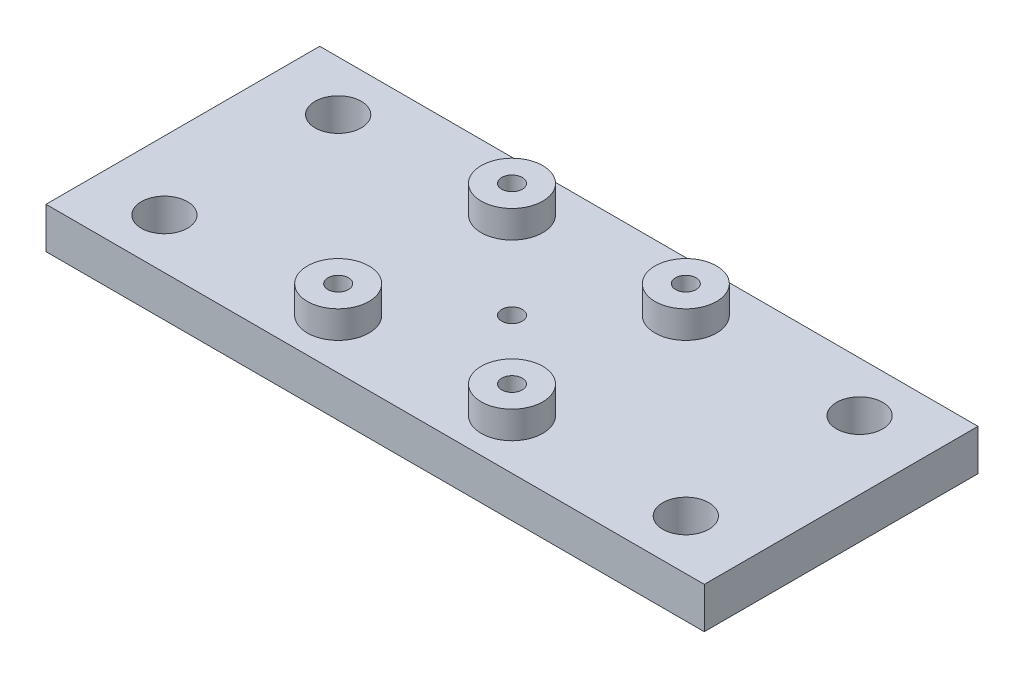
ISO-10303-21;
HEADER;
FILE_DESCRIPTION(('STEP AP214'),'2;1');
FILE_NAME('part.step','',(''),(''),'','','');
FILE_SCHEMA(('AUTOMOTIVE_DESIGN { 1 0 10303 214 1 1 1 1 }'));
ENDSEC;
DATA;
#1=APPLICATION_CONTEXT('core data for automotive mechanical design processes');
#2=APPLICATION_PROTOCOL_DEFINITION('international standard','automotive_design',2000,#1);
#3=PRODUCT_CONTEXT('',#1,'mechanical');
#4=PRODUCT('Part','Part','',(#3));
#5=PRODUCT_RELATED_PRODUCT_CATEGORY('part','',(#4));
#6=PRODUCT_DEFINITION_FORMATION('','',#4);
#7=PRODUCT_DEFINITION_CONTEXT('part definition',#1,'design');
#8=PRODUCT_DEFINITION('design','',#6,#7);
#9=PRODUCT_DEFINITION_SHAPE('','',#8);
#10=(LENGTH_UNIT() NAMED_UNIT(*) SI_UNIT(.MILLI.,.METRE.));
#11=(NAMED_UNIT(*) PLANE_ANGLE_UNIT() SI_UNIT($,.RADIAN.));
#12=(NAMED_UNIT(*) SI_UNIT($,.STERADIAN.) SOLID_ANGLE_UNIT());
#13=UNCERTAINTY_MEASURE_WITH_UNIT(LENGTH_MEASURE(1.E-05),#10,'distance_accuracy_value','');
#14=(GEOMETRIC_REPRESENTATION_CONTEXT(3) GLOBAL_UNCERTAINTY_ASSIGNED_CONTEXT((#13)) GLOBAL_UNIT_ASSIGNED_CONTEXT((#10,
#11,#12)) REPRESENTATION_CONTEXT('',''));
#15=CARTESIAN_POINT('',(0.,0.,0.));
#16=DIRECTION('',(0.,0.,1.));
#17=DIRECTION('',(1.,0.,0.));
#18=AXIS2_PLACEMENT_3D('',#15,#16,#17);
#19=CARTESIAN_POINT('',(70.6318886716207,6.,-52.4553945983698));
#20=DIRECTION('',(0.,-1.,0.));
#21=DIRECTION('',(0.,0.,-1.));
#22=AXIS2_PLACEMENT_3D('',#19,#20,#21);
#23=CYLINDRICAL_SURFACE('',#22,1.5);
#24=CARTESIAN_POINT('',(70.6318886716207,6.,-52.4553945983698));
#25=DIRECTION('',(0.,1.,0.));
#26=DIRECTION('',(0.,0.,1.));
#27=AXIS2_PLACEMENT_3D('',#24,#25,#26);
#28=CIRCLE('',#27,1.5);
#29=CARTESIAN_POINT('',(70.6318886716207,6.,-50.9553945983698));
#30=VERTEX_POINT('',#29);
#31=EDGE_CURVE('E121',#30,#30,#28,.T.);
#32=ORIENTED_EDGE('',*,*,#31,.T.);
#33=EDGE_LOOP('',(#32));
#34=FACE_BOUND('',#33,.T.);
#35=CARTESIAN_POINT('',(70.6318886716207,3.3,-52.4553945983698));
#36=DIRECTION('',(0.,-1.,0.));
#37=DIRECTION('',(0.,0.,-1.));
#38=AXIS2_PLACEMENT_3D('',#35,#36,#37);
#39=CIRCLE('',#38,1.5);
#40=CARTESIAN_POINT('',(70.6318886716207,3.3,-53.9553945983698));
#41=VERTEX_POINT('',#40);
#42=EDGE_CURVE('E45',#41,#41,#39,.T.);
#43=ORIENTED_EDGE('',*,*,#42,.T.);
#44=EDGE_LOOP('',(#43));
#45=FACE_BOUND('',#44,.T.);
#46=ADVANCED_FACE('F41',(#34,#45),#23,.F.);
#47=CARTESIAN_POINT('',(0.,6.,0.));
#48=DIRECTION('',(0.,1.,0.));
#49=DIRECTION('',(0.,0.,1.));
#50=AXIS2_PLACEMENT_3D('',#47,#48,#49);
#51=PLANE('',#50);
#52=CARTESIAN_POINT('',(57.9318886716207,6.,-65.1553945983698));
#53=DIRECTION('',(0.,1.,0.));
#54=DIRECTION('',(0.,0.,1.));
#55=AXIS2_PLACEMENT_3D('',#52,#53,#54);
#56=CIRCLE('',#55,4.50000000000001);
#57=CARTESIAN_POINT('',(57.9318886716207,6.,-60.6553945983697));
#58=VERTEX_POINT('',#57);
#59=EDGE_CURVE('E231',#58,#58,#56,.T.);
#60=ORIENTED_EDGE('',*,*,#59,.F.);
#61=EDGE_LOOP('',(#60));
#62=FACE_BOUND('',#61,.T.);
#63=CARTESIAN_POINT('',(32.5318886716207,6.,-39.7553945983697));
#64=DIRECTION('',(0.,1.,0.));
#65=DIRECTION('',(0.,0.,1.));
#66=AXIS2_PLACEMENT_3D('',#63,#64,#65);
#67=CIRCLE('',#66,3.37343749999996);
#68=CARTESIAN_POINT('',(32.5318886716207,6.,-36.3819570983698));
#69=VERTEX_POINT('',#68);
#70=EDGE_CURVE('E176',#69,#69,#67,.T.);
#71=ORIENTED_EDGE('',*,*,#70,.F.);
#72=EDGE_LOOP('',(#71));
#73=FACE_BOUND('',#72,.T.);
#74=CARTESIAN_POINT('',(32.5318886716207,6.,-65.1553945983698));
#75=DIRECTION('',(0.,1.,0.));
#76=DIRECTION('',(0.,0.,1.));
#77=AXIS2_PLACEMENT_3D('',#74,#75,#76);
#78=CIRCLE('',#77,3.37343749999996);
#79=CARTESIAN_POINT('',(32.5318886716207,6.,-61.7819570983698));
#80=VERTEX_POINT('',#79);
#81=EDGE_CURVE('E115',#80,#80,#78,.T.);
#82=ORIENTED_EDGE('',*,*,#81,.F.);
#83=EDGE_LOOP('',(#82));
#84=FACE_BOUND('',#83,.T.);
#85=DIRECTION('',(0.,0.,-1.));
#86=VECTOR('',#85,1.);
#87=CARTESIAN_POINT('',(22.5318886716207,6.,0.));
#88=LINE('',#87,#86);
#89=CARTESIAN_POINT('',(22.5318886716207,6.,-32.4553945983698));
#90=VERTEX_POINT('',#89);
#91=CARTESIAN_POINT('',(22.5318886716207,6.,-72.4553945983698));
#92=VERTEX_POINT('',#91);
#93=EDGE_CURVE('E111',#90,#92,#88,.T.);
#94=ORIENTED_EDGE('',*,*,#93,.F.);
#95=DIRECTION('',(-1.,0.,0.));
#96=VECTOR('',#95,1.);
#97=CARTESIAN_POINT('',(0.,6.,-32.4553945983698));
#98=LINE('',#97,#96);
#99=CARTESIAN_POINT('',(118.731888671621,6.,-32.4553945983698));
#100=VERTEX_POINT('',#99);
#101=EDGE_CURVE('E96',#100,#90,#98,.T.);
#102=ORIENTED_EDGE('',*,*,#101,.F.);
#103=DIRECTION('',(0.,0.,-1.));
#104=VECTOR('',#103,1.);
#105=CARTESIAN_POINT('',(118.731888671621,6.,0.));
#106=LINE('',#105,#104);
#107=CARTESIAN_POINT('',(118.731888671621,6.,-72.4553945983698));
#108=VERTEX_POINT('',#107);
#109=EDGE_CURVE('E105',#100,#108,#106,.T.);
#110=ORIENTED_EDGE('',*,*,#109,.T.);
#111=DIRECTION('',(-1.,0.,0.));
#112=VECTOR('',#111,1.);
#113=CARTESIAN_POINT('',(0.,6.,-72.4553945983698));
#114=LINE('',#113,#112);
#115=EDGE_CURVE('E60',#108,#92,#114,.T.);
#116=ORIENTED_EDGE('',*,*,#115,.T.);
#117=EDGE_LOOP('',(#94,#102,#110,#116));
#118=FACE_BOUND('',#117,.T.);
#119=ORIENTED_EDGE('',*,*,#31,.F.);
#120=EDGE_LOOP('',(#119));
#121=FACE_BOUND('',#120,.T.);
#122=CARTESIAN_POINT('',(108.731888671621,6.,-39.7553945983698));
#123=DIRECTION('',(0.,1.,0.));
#124=DIRECTION('',(0.,0.,1.));
#125=AXIS2_PLACEMENT_3D('',#122,#123,#124);
#126=CIRCLE('',#125,3.37343749999996);
#127=CARTESIAN_POINT('',(108.731888671621,6.,-36.3819570983698));
#128=VERTEX_POINT('',#127);
#129=EDGE_CURVE('E125',#128,#128,#126,.T.);
#130=ORIENTED_EDGE('',*,*,#129,.F.);
#131=EDGE_LOOP('',(#130));
#132=FACE_BOUND('',#131,.T.);
#133=CARTESIAN_POINT('',(108.731888671621,6.,-65.1553945983698));
#134=DIRECTION('',(0.,1.,0.));
#135=DIRECTION('',(0.,0.,1.));
#136=AXIS2_PLACEMENT_3D('',#133,#134,#135);
#137=CIRCLE('',#136,3.37343749999996);
#138=CARTESIAN_POINT('',(108.731888671621,6.,-61.7819570983698));
#139=VERTEX_POINT('',#138);
#140=EDGE_CURVE('E129',#139,#139,#137,.T.);
#141=ORIENTED_EDGE('',*,*,#140,.F.);
#142=EDGE_LOOP('',(#141));
#143=FACE_BOUND('',#142,.T.);
#144=CARTESIAN_POINT('',(83.3318886716207,6.,-65.1553945983698));
#145=DIRECTION('',(0.,1.,0.));
#146=DIRECTION('',(0.,0.,1.));
#147=AXIS2_PLACEMENT_3D('',#144,#145,#146);
#148=CIRCLE('',#147,4.50000000000001);
#149=CARTESIAN_POINT('',(83.3318886716207,6.,-60.6553945983697));
#150=VERTEX_POINT('',#149);
#151=EDGE_CURVE('E52',#150,#150,#148,.T.);
#152=ORIENTED_EDGE('',*,*,#151,.F.);
#153=EDGE_LOOP('',(#152));
#154=FACE_BOUND('',#153,.T.);
#155=CARTESIAN_POINT('',(57.9318886716207,6.,-39.7553945983698));
#156=DIRECTION('',(0.,1.,0.));
#157=DIRECTION('',(0.,0.,1.));
#158=AXIS2_PLACEMENT_3D('',#155,#156,#157);
#159=CIRCLE('',#158,4.50000000000001);
#160=CARTESIAN_POINT('',(57.9318886716207,6.,-35.2553945983698));
#161=VERTEX_POINT('',#160);
#162=EDGE_CURVE('E11',#161,#161,#159,.T.);
#163=ORIENTED_EDGE('',*,*,#162,.F.);
#164=EDGE_LOOP('',(#163));
#165=FACE_BOUND('',#164,.T.);
#166=CARTESIAN_POINT('',(83.3318886716207,6.,-39.7553945983698));
#167=DIRECTION('',(0.,1.,0.));
#168=DIRECTION('',(0.,0.,-1.));
#169=AXIS2_PLACEMENT_3D('',#166,#167,#168);
#170=CIRCLE('',#169,4.50000000000001);
#171=CARTESIAN_POINT('',(83.3318886716207,6.,-44.2553945983698));
#172=VERTEX_POINT('',#171);
#173=EDGE_CURVE('E198',#172,#172,#170,.T.);
#174=ORIENTED_EDGE('',*,*,#173,.F.);
#175=EDGE_LOOP('',(#174));
#176=FACE_BOUND('',#175,.T.);
#177=ADVANCED_FACE('F109',(#62,#73,#84,#118,#121,#132,#143,#154,#165,#176),#51,.T.);
#178=CARTESIAN_POINT('',(22.5318886716207,6.,0.));
#179=DIRECTION('',(-1.,0.,0.));
#180=DIRECTION('',(0.,0.,1.));
#181=AXIS2_PLACEMENT_3D('',#178,#179,#180);
#182=PLANE('',#181);
#183=DIRECTION('',(0.,0.,-1.));
#184=VECTOR('',#183,1.);
#185=CARTESIAN_POINT('',(22.5318886716207,0.,0.));
#186=LINE('',#185,#184);
#187=CARTESIAN_POINT('',(22.5318886716207,0.,-32.4553945983698));
#188=VERTEX_POINT('',#187);
#189=CARTESIAN_POINT('',(22.5318886716207,0.,-72.4553945983698));
#190=VERTEX_POINT('',#189);
#191=EDGE_CURVE('E142',#188,#190,#186,.T.);
#192=ORIENTED_EDGE('',*,*,#191,.F.);
#193=DIRECTION('',(0.,-1.,0.));
#194=VECTOR('',#193,1.);
#195=CARTESIAN_POINT('',(22.5318886716207,6.,-32.4553945983698));
#196=LINE('',#195,#194);
#197=EDGE_CURVE('E87',#90,#188,#196,.T.);
#198=ORIENTED_EDGE('',*,*,#197,.F.);
#199=ORIENTED_EDGE('',*,*,#93,.T.);
#200=DIRECTION('',(0.,-1.,0.));
#201=VECTOR('',#200,1.);
#202=CARTESIAN_POINT('',(22.5318886716207,6.,-72.4553945983698));
#203=LINE('',#202,#201);
#204=EDGE_CURVE('E84',#92,#190,#203,.T.);
#205=ORIENTED_EDGE('',*,*,#204,.T.);
#206=EDGE_LOOP('',(#192,#198,#199,#205));
#207=FACE_BOUND('',#206,.T.);
#208=ADVANCED_FACE('F191',(#207),#182,.T.);
#209=CARTESIAN_POINT('',(0.,6.,-32.4553945983698));
#210=DIRECTION('',(0.,0.,1.));
#211=DIRECTION('',(1.,0.,0.));
#212=AXIS2_PLACEMENT_3D('',#209,#210,#211);
#213=PLANE('',#212);
#214=DIRECTION('',(-1.,0.,0.));
#215=VECTOR('',#214,1.);
#216=CARTESIAN_POINT('',(0.,0.,-32.4553945983698));
#217=LINE('',#216,#215);
#218=CARTESIAN_POINT('',(118.731888671621,0.,-32.4553945983698));
#219=VERTEX_POINT('',#218);
#220=EDGE_CURVE('E98',#219,#188,#217,.T.);
#221=ORIENTED_EDGE('',*,*,#220,.F.);
#222=DIRECTION('',(0.,-1.,0.));
#223=VECTOR('',#222,1.);
#224=CARTESIAN_POINT('',(118.731888671621,6.,-32.4553945983698));
#225=LINE('',#224,#223);
#226=EDGE_CURVE('E92',#100,#219,#225,.T.);
#227=ORIENTED_EDGE('',*,*,#226,.F.);
#228=ORIENTED_EDGE('',*,*,#101,.T.);
#229=ORIENTED_EDGE('',*,*,#197,.T.);
#230=EDGE_LOOP('',(#221,#227,#228,#229));
#231=FACE_BOUND('',#230,.T.);
#232=ADVANCED_FACE('F94',(#231),#213,.T.);
#233=CARTESIAN_POINT('',(118.731888671621,6.,0.));
#234=DIRECTION('',(-1.,0.,0.));
#235=DIRECTION('',(0.,0.,1.));
#236=AXIS2_PLACEMENT_3D('',#233,#234,#235);
#237=PLANE('',#236);
#238=DIRECTION('',(0.,0.,-1.));
#239=VECTOR('',#238,1.);
#240=CARTESIAN_POINT('',(118.731888671621,0.,0.));
#241=LINE('',#240,#239);
#242=CARTESIAN_POINT('',(118.731888671621,0.,-72.4553945983698));
#243=VERTEX_POINT('',#242);
#244=EDGE_CURVE('E147',#219,#243,#241,.T.);
#245=ORIENTED_EDGE('',*,*,#244,.T.);
#246=DIRECTION('',(0.,-1.,0.));
#247=VECTOR('',#246,1.);
#248=CARTESIAN_POINT('',(118.731888671621,6.,-72.4553945983698));
#249=LINE('',#248,#247);
#250=EDGE_CURVE('E102',#108,#243,#249,.T.);
#251=ORIENTED_EDGE('',*,*,#250,.F.);
#252=ORIENTED_EDGE('',*,*,#109,.F.);
#253=ORIENTED_EDGE('',*,*,#226,.T.);
#254=EDGE_LOOP('',(#245,#251,#252,#253));
#255=FACE_BOUND('',#254,.T.);
#256=ADVANCED_FACE('F106',(#255),#237,.F.);
#257=CARTESIAN_POINT('',(108.731888671621,6.,-39.7553945983698));
#258=DIRECTION('',(0.,-1.,0.));
#259=DIRECTION('',(0.,0.,-1.));
#260=AXIS2_PLACEMENT_3D('',#257,#258,#259);
#261=CYLINDRICAL_SURFACE('',#260,3.37343749999996);
#262=ORIENTED_EDGE('',*,*,#129,.T.);
#263=EDGE_LOOP('',(#262));
#264=FACE_BOUND('',#263,.T.);
#265=CARTESIAN_POINT('',(108.731888671621,0.,-39.7553945983698));
#266=DIRECTION('',(0.,1.,0.));
#267=DIRECTION('',(0.,0.,1.));
#268=AXIS2_PLACEMENT_3D('',#265,#266,#267);
#269=CIRCLE('',#268,3.37343749999996);
#270=CARTESIAN_POINT('',(108.731888671621,0.,-36.3819570983698));
#271=VERTEX_POINT('',#270);
#272=EDGE_CURVE('E168',#271,#271,#269,.T.);
#273=ORIENTED_EDGE('',*,*,#272,.F.);
#274=EDGE_LOOP('',(#273));
#275=FACE_BOUND('',#274,.T.);
#276=ADVANCED_FACE('F293',(#264,#275),#261,.F.);
#277=CARTESIAN_POINT('',(57.9318886716207,6.,-65.1553945983698));
#278=DIRECTION('',(0.,-1.,0.));
#279=DIRECTION('',(0.,0.,-1.));
#280=AXIS2_PLACEMENT_3D('',#277,#278,#279);
#281=CYLINDRICAL_SURFACE('',#280,1.5);
#282=CARTESIAN_POINT('',(57.9318886716207,0.,-65.1553945983698));
#283=DIRECTION('',(0.,1.,0.));
#284=DIRECTION('',(0.,0.,1.));
#285=AXIS2_PLACEMENT_3D('',#282,#283,#284);
#286=CIRCLE('',#285,1.5);
#287=CARTESIAN_POINT('',(57.9318886716207,0.,-63.6553945983697));
#288=VERTEX_POINT('',#287);
#289=EDGE_CURVE('E164',#288,#288,#286,.T.);
#290=ORIENTED_EDGE('',*,*,#289,.F.);
#291=EDGE_LOOP('',(#290));
#292=FACE_BOUND('',#291,.T.);
#293=CARTESIAN_POINT('',(57.9318886716207,10.,-65.1553945983698));
#294=DIRECTION('',(0.,1.,0.));
#295=DIRECTION('',(0.,0.,1.));
#296=AXIS2_PLACEMENT_3D('',#293,#294,#295);
#297=CIRCLE('',#296,1.5);
#298=CARTESIAN_POINT('',(57.9318886716207,10.,-63.6553945983697));
#299=VERTEX_POINT('',#298);
#300=EDGE_CURVE('E227',#299,#299,#297,.T.);
#301=ORIENTED_EDGE('',*,*,#300,.T.);
#302=EDGE_LOOP('',(#301));
#303=FACE_BOUND('',#302,.T.);
#304=ADVANCED_FACE('F315',(#292,#303),#281,.F.);
#305=CARTESIAN_POINT('',(83.3318886716207,6.,-65.1553945983698));
#306=DIRECTION('',(0.,-1.,0.));
#307=DIRECTION('',(0.,0.,-1.));
#308=AXIS2_PLACEMENT_3D('',#305,#306,#307);
#309=CYLINDRICAL_SURFACE('',#308,1.5);
#310=CARTESIAN_POINT('',(83.3318886716207,0.,-65.1553945983698));
#311=DIRECTION('',(0.,1.,0.));
#312=DIRECTION('',(0.,0.,1.));
#313=AXIS2_PLACEMENT_3D('',#310,#311,#312);
#314=CIRCLE('',#313,1.5);
#315=CARTESIAN_POINT('',(83.3318886716207,0.,-63.6553945983697));
#316=VERTEX_POINT('',#315);
#317=EDGE_CURVE('E160',#316,#316,#314,.T.);
#318=ORIENTED_EDGE('',*,*,#317,.F.);
#319=EDGE_LOOP('',(#318));
#320=FACE_BOUND('',#319,.T.);
#321=CARTESIAN_POINT('',(83.3318886716207,10.,-65.1553945983698));
#322=DIRECTION('',(0.,-1.,0.));
#323=DIRECTION('',(0.,0.,1.));
#324=AXIS2_PLACEMENT_3D('',#321,#322,#323);
#325=CIRCLE('',#324,1.5);
#326=CARTESIAN_POINT('',(83.3318886716207,10.,-63.6553945983697));
#327=VERTEX_POINT('',#326);
#328=EDGE_CURVE('E219',#327,#327,#325,.T.);
#329=ORIENTED_EDGE('',*,*,#328,.F.);
#330=EDGE_LOOP('',(#329));
#331=FACE_BOUND('',#330,.T.);
#332=ADVANCED_FACE('F323',(#320,#331),#309,.F.);
#333=CARTESIAN_POINT('',(83.3318886716207,6.,-39.7553945983698));
#334=DIRECTION('',(0.,-1.,0.));
#335=DIRECTION('',(0.,0.,-1.));
#336=AXIS2_PLACEMENT_3D('',#333,#334,#335);
#337=CYLINDRICAL_SURFACE('',#336,1.5);
#338=CARTESIAN_POINT('',(83.3318886716207,0.,-39.7553945983698));
#339=DIRECTION('',(0.,1.,0.));
#340=DIRECTION('',(0.,0.,1.));
#341=AXIS2_PLACEMENT_3D('',#338,#339,#340);
#342=CIRCLE('',#341,1.5);
#343=CARTESIAN_POINT('',(83.3318886716207,0.,-38.2553945983698));
#344=VERTEX_POINT('',#343);
#345=EDGE_CURVE('E156',#344,#344,#342,.T.);
#346=ORIENTED_EDGE('',*,*,#345,.F.);
#347=EDGE_LOOP('',(#346));
#348=FACE_BOUND('',#347,.T.);
#349=CARTESIAN_POINT('',(83.3318886716207,10.,-39.7553945983698));
#350=DIRECTION('',(0.,1.,0.));
#351=DIRECTION('',(0.,0.,-1.));
#352=AXIS2_PLACEMENT_3D('',#349,#350,#351);
#353=CIRCLE('',#352,1.5);
#354=CARTESIAN_POINT('',(83.3318886716207,10.,-41.2553945983698));
#355=VERTEX_POINT('',#354);
#356=EDGE_CURVE('E202',#355,#355,#353,.T.);
#357=ORIENTED_EDGE('',*,*,#356,.T.);
#358=EDGE_LOOP('',(#357));
#359=FACE_BOUND('',#358,.T.);
#360=ADVANCED_FACE('F332',(#348,#359),#337,.F.);
#361=CARTESIAN_POINT('',(57.9318886716207,6.,-39.7553945983698));
#362=DIRECTION('',(0.,-1.,0.));
#363=DIRECTION('',(0.,0.,-1.));
#364=AXIS2_PLACEMENT_3D('',#361,#362,#363);
#365=CYLINDRICAL_SURFACE('',#364,1.5);
#366=CARTESIAN_POINT('',(57.9318886716207,0.,-39.7553945983698));
#367=DIRECTION('',(0.,1.,0.));
#368=DIRECTION('',(0.,0.,1.));
#369=AXIS2_PLACEMENT_3D('',#366,#367,#368);
#370=CIRCLE('',#369,1.5);
#371=CARTESIAN_POINT('',(57.9318886716207,0.,-38.2553945983698));
#372=VERTEX_POINT('',#371);
#373=EDGE_CURVE('E152',#372,#372,#370,.T.);
#374=ORIENTED_EDGE('',*,*,#373,.F.);
#375=EDGE_LOOP('',(#374));
#376=FACE_BOUND('',#375,.T.);
#377=CARTESIAN_POINT('',(57.9318886716207,10.,-39.7553945983698));
#378=DIRECTION('',(0.,-1.,0.));
#379=DIRECTION('',(0.,0.,-1.));
#380=AXIS2_PLACEMENT_3D('',#377,#378,#379);
#381=CIRCLE('',#380,1.5);
#382=CARTESIAN_POINT('',(57.9318886716207,10.,-41.2553945983698));
#383=VERTEX_POINT('',#382);
#384=EDGE_CURVE('E207',#383,#383,#381,.T.);
#385=ORIENTED_EDGE('',*,*,#384,.F.);
#386=EDGE_LOOP('',(#385));
#387=FACE_BOUND('',#386,.T.);
#388=ADVANCED_FACE('F286',(#376,#387),#365,.F.);
#389=CARTESIAN_POINT('',(0.,6.,-72.4553945983698));
#390=DIRECTION('',(0.,0.,1.));
#391=DIRECTION('',(1.,0.,0.));
#392=AXIS2_PLACEMENT_3D('',#389,#390,#391);
#393=PLANE('',#392);
#394=DIRECTION('',(-1.,0.,0.));
#395=VECTOR('',#394,1.);
#396=CARTESIAN_POINT('',(0.,0.,-72.4553945983698));
#397=LINE('',#396,#395);
#398=EDGE_CURVE('E77',#243,#190,#397,.T.);
#399=ORIENTED_EDGE('',*,*,#398,.T.);
#400=ORIENTED_EDGE('',*,*,#204,.F.);
#401=ORIENTED_EDGE('',*,*,#115,.F.);
#402=ORIENTED_EDGE('',*,*,#250,.T.);
#403=EDGE_LOOP('',(#399,#400,#401,#402));
#404=FACE_BOUND('',#403,.T.);
#405=ADVANCED_FACE('F248',(#404),#393,.F.);
#406=CARTESIAN_POINT('',(32.5318886716207,6.,-65.1553945983698));
#407=DIRECTION('',(0.,-1.,0.));
#408=DIRECTION('',(0.,0.,-1.));
#409=AXIS2_PLACEMENT_3D('',#406,#407,#408);
#410=CYLINDRICAL_SURFACE('',#409,3.37343749999996);
#411=ORIENTED_EDGE('',*,*,#81,.T.);
#412=EDGE_LOOP('',(#411));
#413=FACE_BOUND('',#412,.T.);
#414=CARTESIAN_POINT('',(32.5318886716207,0.,-65.1553945983698));
#415=DIRECTION('',(0.,1.,0.));
#416=DIRECTION('',(0.,0.,1.));
#417=AXIS2_PLACEMENT_3D('',#414,#415,#416);
#418=CIRCLE('',#417,3.37343749999996);
#419=CARTESIAN_POINT('',(32.5318886716207,0.,-61.7819570983698));
#420=VERTEX_POINT('',#419);
#421=EDGE_CURVE('E137',#420,#420,#418,.T.);
#422=ORIENTED_EDGE('',*,*,#421,.F.);
#423=EDGE_LOOP('',(#422));
#424=FACE_BOUND('',#423,.T.);
#425=ADVANCED_FACE('F244',(#413,#424),#410,.F.);
#426=CARTESIAN_POINT('',(32.5318886716207,6.,-39.7553945983697));
#427=DIRECTION('',(0.,-1.,0.));
#428=DIRECTION('',(0.,0.,-1.));
#429=AXIS2_PLACEMENT_3D('',#426,#427,#428);
#430=CYLINDRICAL_SURFACE('',#429,3.37343749999996);
#431=ORIENTED_EDGE('',*,*,#70,.T.);
#432=EDGE_LOOP('',(#431));
#433=FACE_BOUND('',#432,.T.);
#434=CARTESIAN_POINT('',(32.5318886716207,0.,-39.7553945983697));
#435=DIRECTION('',(0.,1.,0.));
#436=DIRECTION('',(0.,0.,1.));
#437=AXIS2_PLACEMENT_3D('',#434,#435,#436);
#438=CIRCLE('',#437,3.37343749999996);
#439=CARTESIAN_POINT('',(32.5318886716207,0.,-36.3819570983698));
#440=VERTEX_POINT('',#439);
#441=EDGE_CURVE('E133',#440,#440,#438,.T.);
#442=ORIENTED_EDGE('',*,*,#441,.F.);
#443=EDGE_LOOP('',(#442));
#444=FACE_BOUND('',#443,.T.);
#445=ADVANCED_FACE('F43',(#433,#444),#430,.F.);
#446=CARTESIAN_POINT('',(108.731888671621,6.,-65.1553945983698));
#447=DIRECTION('',(0.,-1.,0.));
#448=DIRECTION('',(0.,0.,-1.));
#449=AXIS2_PLACEMENT_3D('',#446,#447,#448);
#450=CYLINDRICAL_SURFACE('',#449,3.37343749999996);
#451=ORIENTED_EDGE('',*,*,#140,.T.);
#452=EDGE_LOOP('',(#451));
#453=FACE_BOUND('',#452,.T.);
#454=CARTESIAN_POINT('',(108.731888671621,0.,-65.1553945983698));
#455=DIRECTION('',(0.,1.,0.));
#456=DIRECTION('',(0.,0.,1.));
#457=AXIS2_PLACEMENT_3D('',#454,#455,#456);
#458=CIRCLE('',#457,3.37343749999996);
#459=CARTESIAN_POINT('',(108.731888671621,0.,-61.7819570983698));
#460=VERTEX_POINT('',#459);
#461=EDGE_CURVE('E172',#460,#460,#458,.T.);
#462=ORIENTED_EDGE('',*,*,#461,.F.);
#463=EDGE_LOOP('',(#462));
#464=FACE_BOUND('',#463,.T.);
#465=ADVANCED_FACE('F254',(#453,#464),#450,.F.);
#466=CARTESIAN_POINT('',(0.,0.,0.));
#467=DIRECTION('',(0.,1.,0.));
#468=DIRECTION('',(0.,0.,1.));
#469=AXIS2_PLACEMENT_3D('',#466,#467,#468);
#470=PLANE('',#469);
#471=CARTESIAN_POINT('',(70.6318886716207,0.,-52.4553945983698));
#472=DIRECTION('',(0.,-1.,0.));
#473=DIRECTION('',(0.,0.,-1.));
#474=AXIS2_PLACEMENT_3D('',#471,#472,#473);
#475=CIRCLE('',#474,2.75000000000001);
#476=CARTESIAN_POINT('',(70.6318886716207,0.,-55.2053945983698));
#477=VERTEX_POINT('',#476);
#478=EDGE_CURVE('E534',#477,#477,#475,.T.);
#479=ORIENTED_EDGE('',*,*,#478,.F.);
#480=EDGE_LOOP('',(#479));
#481=FACE_BOUND('',#480,.T.);
#482=ORIENTED_EDGE('',*,*,#441,.T.);
#483=EDGE_LOOP('',(#482));
#484=FACE_BOUND('',#483,.T.);
#485=ORIENTED_EDGE('',*,*,#421,.T.);
#486=EDGE_LOOP('',(#485));
#487=FACE_BOUND('',#486,.T.);
#488=ORIENTED_EDGE('',*,*,#191,.T.);
#489=ORIENTED_EDGE('',*,*,#398,.F.);
#490=ORIENTED_EDGE('',*,*,#244,.F.);
#491=ORIENTED_EDGE('',*,*,#220,.T.);
#492=EDGE_LOOP('',(#488,#489,#490,#491));
#493=FACE_BOUND('',#492,.T.);
#494=ORIENTED_EDGE('',*,*,#373,.T.);
#495=EDGE_LOOP('',(#494));
#496=FACE_BOUND('',#495,.T.);
#497=ORIENTED_EDGE('',*,*,#345,.T.);
#498=EDGE_LOOP('',(#497));
#499=FACE_BOUND('',#498,.T.);
#500=ORIENTED_EDGE('',*,*,#317,.T.);
#501=EDGE_LOOP('',(#500));
#502=FACE_BOUND('',#501,.T.);
#503=ORIENTED_EDGE('',*,*,#289,.T.);
#504=EDGE_LOOP('',(#503));
#505=FACE_BOUND('',#504,.T.);
#506=ORIENTED_EDGE('',*,*,#272,.T.);
#507=EDGE_LOOP('',(#506));
#508=FACE_BOUND('',#507,.T.);
#509=ORIENTED_EDGE('',*,*,#461,.T.);
#510=EDGE_LOOP('',(#509));
#511=FACE_BOUND('',#510,.T.);
#512=ADVANCED_FACE('F251',(#481,#484,#487,#493,#496,#499,#502,#505,#508,#511),#470,.F.);
#513=CARTESIAN_POINT('',(57.9318886716207,10.,-65.1553945983698));
#514=DIRECTION('',(0.,1.,0.));
#515=DIRECTION('',(0.,0.,1.));
#516=AXIS2_PLACEMENT_3D('',#513,#514,#515);
#517=PLANE('',#516);
#518=CARTESIAN_POINT('',(57.9318886716207,10.,-65.1553945983698));
#519=DIRECTION('',(0.,1.,0.));
#520=DIRECTION('',(0.,0.,1.));
#521=AXIS2_PLACEMENT_3D('',#518,#519,#520);
#522=CIRCLE('',#521,4.50000000000001);
#523=CARTESIAN_POINT('',(57.9318886716207,10.,-60.6553945983697));
#524=VERTEX_POINT('',#523);
#525=EDGE_CURVE('E138',#524,#524,#522,.T.);
#526=ORIENTED_EDGE('',*,*,#525,.T.);
#527=EDGE_LOOP('',(#526));
#528=FACE_BOUND('',#527,.T.);
#529=ORIENTED_EDGE('',*,*,#300,.F.);
#530=EDGE_LOOP('',(#529));
#531=FACE_BOUND('',#530,.T.);
#532=ADVANCED_FACE('F253',(#528,#531),#517,.T.);
#533=CARTESIAN_POINT('',(57.9318886716207,10.,-65.1553945983698));
#534=DIRECTION('',(0.,-1.,0.));
#535=DIRECTION('',(0.,0.,-1.));
#536=AXIS2_PLACEMENT_3D('',#533,#534,#535);
#537=CYLINDRICAL_SURFACE('',#536,4.50000000000001);
#538=ORIENTED_EDGE('',*,*,#525,.F.);
#539=EDGE_LOOP('',(#538));
#540=FACE_BOUND('',#539,.T.);
#541=ORIENTED_EDGE('',*,*,#59,.T.);
#542=EDGE_LOOP('',(#541));
#543=FACE_BOUND('',#542,.T.);
#544=ADVANCED_FACE('F400',(#540,#543),#537,.T.);
#545=CARTESIAN_POINT('',(83.3318886716207,10.,-65.1553945983698));
#546=DIRECTION('',(0.,-1.,0.));
#547=DIRECTION('',(0.,0.,-1.));
#548=AXIS2_PLACEMENT_3D('',#545,#546,#547);
#549=CYLINDRICAL_SURFACE('',#548,4.50000000000001);
#550=CARTESIAN_POINT('',(83.3318886716207,10.,-65.1553945983698));
#551=DIRECTION('',(0.,-1.,0.));
#552=DIRECTION('',(0.,0.,1.));
#553=AXIS2_PLACEMENT_3D('',#550,#551,#552);
#554=CIRCLE('',#553,4.50000000000001);
#555=CARTESIAN_POINT('',(83.3318886716207,10.,-60.6553945983697));
#556=VERTEX_POINT('',#555);
#557=EDGE_CURVE('E223',#556,#556,#554,.T.);
#558=ORIENTED_EDGE('',*,*,#557,.T.);
#559=EDGE_LOOP('',(#558));
#560=FACE_BOUND('',#559,.T.);
#561=ORIENTED_EDGE('',*,*,#151,.T.);
#562=EDGE_LOOP('',(#561));
#563=FACE_BOUND('',#562,.T.);
#564=ADVANCED_FACE('F187',(#560,#563),#549,.T.);
#565=CARTESIAN_POINT('',(83.3318886716207,10.,-65.1553945983698));
#566=DIRECTION('',(0.,1.,0.));
#567=DIRECTION('',(0.,0.,1.));
#568=AXIS2_PLACEMENT_3D('',#565,#566,#567);
#569=PLANE('',#568);
#570=ORIENTED_EDGE('',*,*,#328,.T.);
#571=EDGE_LOOP('',(#570));
#572=FACE_BOUND('',#571,.T.);
#573=ORIENTED_EDGE('',*,*,#557,.F.);
#574=EDGE_LOOP('',(#573));
#575=FACE_BOUND('',#574,.T.);
#576=ADVANCED_FACE('F420',(#572,#575),#569,.T.);
#577=CARTESIAN_POINT('',(57.9318886716207,10.,-39.7553945983698));
#578=DIRECTION('',(0.,-1.,0.));
#579=DIRECTION('',(0.,0.,-1.));
#580=AXIS2_PLACEMENT_3D('',#577,#578,#579);
#581=CYLINDRICAL_SURFACE('',#580,4.50000000000001);
#582=CARTESIAN_POINT('',(57.9318886716207,10.,-39.7553945983698));
#583=DIRECTION('',(0.,-1.,0.));
#584=DIRECTION('',(0.,0.,-1.));
#585=AXIS2_PLACEMENT_3D('',#582,#583,#584);
#586=CIRCLE('',#585,4.50000000000001);
#587=CARTESIAN_POINT('',(57.9318886716207,10.,-44.2553945983698));
#588=VERTEX_POINT('',#587);
#589=EDGE_CURVE('E215',#588,#588,#586,.T.);
#590=ORIENTED_EDGE('',*,*,#589,.T.);
#591=EDGE_LOOP('',(#590));
#592=FACE_BOUND('',#591,.T.);
#593=ORIENTED_EDGE('',*,*,#162,.T.);
#594=EDGE_LOOP('',(#593));
#595=FACE_BOUND('',#594,.T.);
#596=ADVANCED_FACE('F428',(#592,#595),#581,.T.);
#597=CARTESIAN_POINT('',(57.9318886716207,10.,-39.7553945983698));
#598=DIRECTION('',(0.,1.,0.));
#599=DIRECTION('',(0.,0.,-1.));
#600=AXIS2_PLACEMENT_3D('',#597,#598,#599);
#601=PLANE('',#600);
#602=ORIENTED_EDGE('',*,*,#384,.T.);
#603=EDGE_LOOP('',(#602));
#604=FACE_BOUND('',#603,.T.);
#605=ORIENTED_EDGE('',*,*,#589,.F.);
#606=EDGE_LOOP('',(#605));
#607=FACE_BOUND('',#606,.T.);
#608=ADVANCED_FACE('F443',(#604,#607),#601,.T.);
#609=CARTESIAN_POINT('',(83.3318886716207,10.,-39.7553945983698));
#610=DIRECTION('',(0.,1.,0.));
#611=DIRECTION('',(0.,0.,-1.));
#612=AXIS2_PLACEMENT_3D('',#609,#610,#611);
#613=PLANE('',#612);
#614=CARTESIAN_POINT('',(83.3318886716207,10.,-39.7553945983698));
#615=DIRECTION('',(0.,1.,0.));
#616=DIRECTION('',(0.,0.,-1.));
#617=AXIS2_PLACEMENT_3D('',#614,#615,#616);
#618=CIRCLE('',#617,4.50000000000001);
#619=CARTESIAN_POINT('',(83.3318886716207,10.,-44.2553945983698));
#620=VERTEX_POINT('',#619);
#621=EDGE_CURVE('E201',#620,#620,#618,.T.);
#622=ORIENTED_EDGE('',*,*,#621,.T.);
#623=EDGE_LOOP('',(#622));
#624=FACE_BOUND('',#623,.T.);
#625=ORIENTED_EDGE('',*,*,#356,.F.);
#626=EDGE_LOOP('',(#625));
#627=FACE_BOUND('',#626,.T.);
#628=ADVANCED_FACE('F452',(#624,#627),#613,.T.);
#629=CARTESIAN_POINT('',(83.3318886716207,10.,-39.7553945983698));
#630=DIRECTION('',(0.,-1.,0.));
#631=DIRECTION('',(0.,0.,-1.));
#632=AXIS2_PLACEMENT_3D('',#629,#630,#631);
#633=CYLINDRICAL_SURFACE('',#632,4.50000000000001);
#634=ORIENTED_EDGE('',*,*,#621,.F.);
#635=EDGE_LOOP('',(#634));
#636=FACE_BOUND('',#635,.T.);
#637=ORIENTED_EDGE('',*,*,#173,.T.);
#638=EDGE_LOOP('',(#637));
#639=FACE_BOUND('',#638,.T.);
#640=ADVANCED_FACE('F484',(#636,#639),#633,.T.);
#641=CARTESIAN_POINT('',(70.6318886716207,3.3,-52.4553945983698));
#642=DIRECTION('',(0.,-1.,0.));
#643=DIRECTION('',(0.,0.,-1.));
#644=AXIS2_PLACEMENT_3D('',#641,#642,#643);
#645=CYLINDRICAL_SURFACE('',#644,2.75000000000001);
#646=CARTESIAN_POINT('',(70.6318886716207,3.3,-52.4553945983698));
#647=DIRECTION('',(0.,-1.,0.));
#648=DIRECTION('',(0.,0.,-1.));
#649=AXIS2_PLACEMENT_3D('',#646,#647,#648);
#650=CIRCLE('',#649,2.75000000000001);
#651=CARTESIAN_POINT('',(70.6318886716207,3.3,-55.2053945983698));
#652=VERTEX_POINT('',#651);
#653=EDGE_CURVE('E532',#652,#652,#650,.T.);
#654=ORIENTED_EDGE('',*,*,#653,.F.);
#655=EDGE_LOOP('',(#654));
#656=FACE_BOUND('',#655,.T.);
#657=ORIENTED_EDGE('',*,*,#478,.T.);
#658=EDGE_LOOP('',(#657));
#659=FACE_BOUND('',#658,.T.);
#660=ADVANCED_FACE('F493',(#656,#659),#645,.F.);
#661=CARTESIAN_POINT('',(70.6318886716207,3.3,-52.4553945983698));
#662=DIRECTION('',(0.,-1.,0.));
#663=DIRECTION('',(0.,0.,-1.));
#664=AXIS2_PLACEMENT_3D('',#661,#662,#663);
#665=PLANE('',#664);
#666=ORIENTED_EDGE('',*,*,#42,.F.);
#667=EDGE_LOOP('',(#666));
#668=FACE_BOUND('',#667,.T.);
#669=ORIENTED_EDGE('',*,*,#653,.T.);
#670=EDGE_LOOP('',(#669));
#671=FACE_BOUND('',#670,.T.);
#672=ADVANCED_FACE('F505',(#668,#671),#665,.T.);
#673=CLOSED_SHELL('',(#46,#177,#208,#232,#256,#276,#304,#332,#360,#388,#405,#425,#445,#465,#512,
#532,#544,#564,#576,#596,#608,#628,#640,#660,#672));
#674=MANIFOLD_SOLID_BREP('B2',#673);
#675=ADVANCED_BREP_SHAPE_REPRESENTATION('',(#18,#674),#14);
#676=SHAPE_DEFINITION_REPRESENTATION(#9,#675);
ENDSEC;
END-ISO-10303-21;
